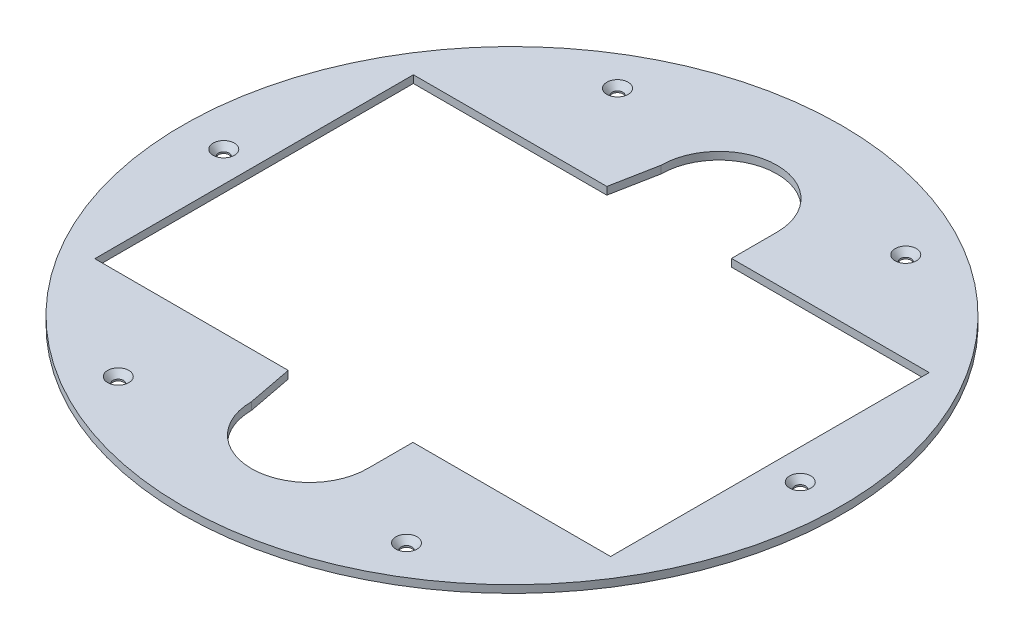
ISO-10303-21;
HEADER;
FILE_DESCRIPTION(('STEP AP214'),'2;1');
FILE_NAME('part.step','',(''),(''),'','','');
FILE_SCHEMA(('AUTOMOTIVE_DESIGN { 1 0 10303 214 1 1 1 1 }'));
ENDSEC;
DATA;
#1=APPLICATION_CONTEXT('core data for automotive mechanical design processes');
#2=APPLICATION_PROTOCOL_DEFINITION('international standard','automotive_design',2000,#1);
#3=PRODUCT_CONTEXT('',#1,'mechanical');
#4=PRODUCT('Part','Part','',(#3));
#5=PRODUCT_RELATED_PRODUCT_CATEGORY('part','',(#4));
#6=PRODUCT_DEFINITION_FORMATION('','',#4);
#7=PRODUCT_DEFINITION_CONTEXT('part definition',#1,'design');
#8=PRODUCT_DEFINITION('design','',#6,#7);
#9=PRODUCT_DEFINITION_SHAPE('','',#8);
#10=(LENGTH_UNIT() NAMED_UNIT(*) SI_UNIT(.MILLI.,.METRE.));
#11=(NAMED_UNIT(*) PLANE_ANGLE_UNIT() SI_UNIT($,.RADIAN.));
#12=(NAMED_UNIT(*) SI_UNIT($,.STERADIAN.) SOLID_ANGLE_UNIT());
#13=UNCERTAINTY_MEASURE_WITH_UNIT(LENGTH_MEASURE(1.E-05),#10,'distance_accuracy_value','');
#14=(GEOMETRIC_REPRESENTATION_CONTEXT(3) GLOBAL_UNCERTAINTY_ASSIGNED_CONTEXT((#13)) GLOBAL_UNIT_ASSIGNED_CONTEXT((#10,
#11,#12)) REPRESENTATION_CONTEXT('',''));
#15=CARTESIAN_POINT('',(0.,0.,0.));
#16=DIRECTION('',(0.,0.,1.));
#17=DIRECTION('',(1.,0.,0.));
#18=AXIS2_PLACEMENT_3D('',#15,#16,#17);
#19=CARTESIAN_POINT('',(0.,3.175,0.));
#20=DIRECTION('',(0.,-1.,0.));
#21=DIRECTION('',(0.,0.,-1.));
#22=AXIS2_PLACEMENT_3D('',#19,#20,#21);
#23=CYLINDRICAL_SURFACE('',#22,137.941576563057);
#24=CARTESIAN_POINT('',(0.,3.175,0.));
#25=DIRECTION('',(0.,1.,0.));
#26=DIRECTION('',(0.,0.,1.));
#27=AXIS2_PLACEMENT_3D('',#24,#25,#26);
#28=CIRCLE('',#27,137.941576563057);
#29=CARTESIAN_POINT('',(0.,3.175,137.941576563057));
#30=VERTEX_POINT('',#29);
#31=EDGE_CURVE('E11',#30,#30,#28,.T.);
#32=ORIENTED_EDGE('',*,*,#31,.F.);
#33=EDGE_LOOP('',(#32));
#34=FACE_BOUND('',#33,.T.);
#35=CARTESIAN_POINT('',(0.,0.,0.));
#36=DIRECTION('',(0.,1.,0.));
#37=DIRECTION('',(0.,0.,1.));
#38=AXIS2_PLACEMENT_3D('',#35,#36,#37);
#39=CIRCLE('',#38,137.941576563057);
#40=CARTESIAN_POINT('',(0.,0.,137.941576563057));
#41=VERTEX_POINT('',#40);
#42=EDGE_CURVE('E34',#41,#41,#39,.T.);
#43=ORIENTED_EDGE('',*,*,#42,.T.);
#44=EDGE_LOOP('',(#43));
#45=FACE_BOUND('',#44,.T.);
#46=ADVANCED_FACE('F31',(#34,#45),#23,.T.);
#47=CARTESIAN_POINT('',(0.,3.175,0.));
#48=DIRECTION('',(0.,1.,0.));
#49=DIRECTION('',(0.,0.,1.));
#50=AXIS2_PLACEMENT_3D('',#47,#48,#49);
#51=PLANE('',#50);
#52=CARTESIAN_POINT('',(-60.3250000000012,3.175,-104.485964966592));
#53=DIRECTION('',(0.,1.,0.));
#54=DIRECTION('',(0.,0.,1.));
#55=AXIS2_PLACEMENT_3D('',#52,#53,#54);
#56=CIRCLE('',#55,4.445);
#57=CARTESIAN_POINT('',(-60.3250000000012,3.175,-100.040964966592));
#58=VERTEX_POINT('',#57);
#59=EDGE_CURVE('E514',#58,#58,#56,.T.);
#60=ORIENTED_EDGE('',*,*,#59,.F.);
#61=EDGE_LOOP('',(#60));
#62=FACE_BOUND('',#61,.T.);
#63=CARTESIAN_POINT('',(60.324999999999,3.175,-104.485964966593));
#64=DIRECTION('',(0.,1.,0.));
#65=DIRECTION('',(0.,0.,1.));
#66=AXIS2_PLACEMENT_3D('',#63,#64,#65);
#67=CIRCLE('',#66,4.445);
#68=CARTESIAN_POINT('',(60.324999999999,3.175,-100.040964966593));
#69=VERTEX_POINT('',#68);
#70=EDGE_CURVE('E520',#69,#69,#67,.T.);
#71=ORIENTED_EDGE('',*,*,#70,.F.);
#72=EDGE_LOOP('',(#71));
#73=FACE_BOUND('',#72,.T.);
#74=CARTESIAN_POINT('',(120.65,3.175,-8.42494447062848E-13));
#75=DIRECTION('',(0.,1.,0.));
#76=DIRECTION('',(0.,0.,1.));
#77=AXIS2_PLACEMENT_3D('',#74,#75,#76);
#78=CIRCLE('',#77,4.44499999999999);
#79=CARTESIAN_POINT('',(120.65,3.175,4.44499999999915));
#80=VERTEX_POINT('',#79);
#81=EDGE_CURVE('E529',#80,#80,#78,.T.);
#82=ORIENTED_EDGE('',*,*,#81,.F.);
#83=EDGE_LOOP('',(#82));
#84=FACE_BOUND('',#83,.T.);
#85=CARTESIAN_POINT('',(60.3250000000005,3.175,104.485964966592));
#86=DIRECTION('',(0.,1.,0.));
#87=DIRECTION('',(0.,0.,1.));
#88=AXIS2_PLACEMENT_3D('',#85,#86,#87);
#89=CIRCLE('',#88,4.445);
#90=CARTESIAN_POINT('',(60.3250000000005,3.175,108.930964966592));
#91=VERTEX_POINT('',#90);
#92=EDGE_CURVE('E538',#91,#91,#89,.T.);
#93=ORIENTED_EDGE('',*,*,#92,.F.);
#94=EDGE_LOOP('',(#93));
#95=FACE_BOUND('',#94,.T.);
#96=CARTESIAN_POINT('',(-60.3249999999998,3.175,104.485964966593));
#97=DIRECTION('',(0.,1.,0.));
#98=DIRECTION('',(0.,0.,1.));
#99=AXIS2_PLACEMENT_3D('',#96,#97,#98);
#100=CIRCLE('',#99,4.445);
#101=CARTESIAN_POINT('',(-60.3249999999998,3.175,108.930964966593));
#102=VERTEX_POINT('',#101);
#103=EDGE_CURVE('E547',#102,#102,#100,.T.);
#104=ORIENTED_EDGE('',*,*,#103,.F.);
#105=EDGE_LOOP('',(#104));
#106=FACE_BOUND('',#105,.T.);
#107=CARTESIAN_POINT('',(-120.65,3.175,0.));
#108=DIRECTION('',(0.,1.,0.));
#109=DIRECTION('',(0.,0.,1.));
#110=AXIS2_PLACEMENT_3D('',#107,#108,#109);
#111=CIRCLE('',#110,4.445);
#112=CARTESIAN_POINT('',(-120.65,3.175,4.445));
#113=VERTEX_POINT('',#112);
#114=EDGE_CURVE('E556',#113,#113,#111,.T.);
#115=ORIENTED_EDGE('',*,*,#114,.F.);
#116=EDGE_LOOP('',(#115));
#117=FACE_BOUND('',#116,.T.);
#118=DIRECTION('',(-1.,0.,0.));
#119=VECTOR('',#118,1.);
#120=CARTESIAN_POINT('',(25.2048780308007,3.175,-66.675));
#121=LINE('',#120,#119);
#122=CARTESIAN_POINT('',(107.95,3.175,-66.675));
#123=VERTEX_POINT('',#122);
#124=CARTESIAN_POINT('',(25.2048780308007,3.175,-66.675));
#125=VERTEX_POINT('',#124);
#126=EDGE_CURVE('E45',#123,#125,#121,.T.);
#127=ORIENTED_EDGE('',*,*,#126,.F.);
#128=DIRECTION('',(0.,0.,-1.));
#129=VECTOR('',#128,1.);
#130=CARTESIAN_POINT('',(107.95,3.175,66.675));
#131=LINE('',#130,#129);
#132=CARTESIAN_POINT('',(107.95,3.175,66.675));
#133=VERTEX_POINT('',#132);
#134=EDGE_CURVE('E138',#133,#123,#131,.T.);
#135=ORIENTED_EDGE('',*,*,#134,.F.);
#136=DIRECTION('',(1.,0.,0.));
#137=VECTOR('',#136,1.);
#138=CARTESIAN_POINT('',(25.2048780308007,3.175,66.675));
#139=LINE('',#138,#137);
#140=CARTESIAN_POINT('',(25.2048780308007,3.175,66.675));
#141=VERTEX_POINT('',#140);
#142=EDGE_CURVE('E141',#141,#133,#139,.T.);
#143=ORIENTED_EDGE('',*,*,#142,.F.);
#144=DIRECTION('',(0.,0.,-1.));
#145=VECTOR('',#144,1.);
#146=CARTESIAN_POINT('',(25.2048780308007,3.175,85.725));
#147=LINE('',#146,#145);
#148=CARTESIAN_POINT('',(25.2048780308007,3.175,85.725));
#149=VERTEX_POINT('',#148);
#150=EDGE_CURVE('E196',#149,#141,#147,.T.);
#151=ORIENTED_EDGE('',*,*,#150,.F.);
#152=CARTESIAN_POINT('',(0.937561054404547,3.175,85.725));
#153=DIRECTION('',(0.,1.,0.));
#154=DIRECTION('',(0.,0.,1.));
#155=AXIS2_PLACEMENT_3D('',#152,#153,#154);
#156=CIRCLE('',#155,24.2673169763962);
#157=CARTESIAN_POINT('',(-23.3297559219917,3.175,85.725));
#158=VERTEX_POINT('',#157);
#159=EDGE_CURVE('E193',#158,#149,#156,.T.);
#160=ORIENTED_EDGE('',*,*,#159,.F.);
#161=DIRECTION('',(0.188563152175409,0.,0.982061066146944));
#162=VECTOR('',#161,1.);
#163=CARTESIAN_POINT('',(-23.3297559219917,3.175,85.725));
#164=LINE('',#163,#162);
#165=CARTESIAN_POINT('',(-26.9875,3.175,66.675));
#166=VERTEX_POINT('',#165);
#167=EDGE_CURVE('E190',#166,#158,#164,.T.);
#168=ORIENTED_EDGE('',*,*,#167,.F.);
#169=DIRECTION('',(1.,0.,0.));
#170=VECTOR('',#169,1.);
#171=CARTESIAN_POINT('',(-107.95,3.175,66.675));
#172=LINE('',#171,#170);
#173=CARTESIAN_POINT('',(-107.95,3.175,66.675));
#174=VERTEX_POINT('',#173);
#175=EDGE_CURVE('E187',#174,#166,#172,.T.);
#176=ORIENTED_EDGE('',*,*,#175,.F.);
#177=DIRECTION('',(0.,0.,1.));
#178=VECTOR('',#177,1.);
#179=CARTESIAN_POINT('',(-107.95,3.175,66.675));
#180=LINE('',#179,#178);
#181=CARTESIAN_POINT('',(-107.95,3.175,-66.675));
#182=VERTEX_POINT('',#181);
#183=EDGE_CURVE('E184',#182,#174,#180,.T.);
#184=ORIENTED_EDGE('',*,*,#183,.F.);
#185=DIRECTION('',(-1.,0.,0.));
#186=VECTOR('',#185,1.);
#187=CARTESIAN_POINT('',(-107.95,3.175,-66.675));
#188=LINE('',#187,#186);
#189=CARTESIAN_POINT('',(-26.9875,3.175,-66.675));
#190=VERTEX_POINT('',#189);
#191=EDGE_CURVE('E181',#190,#182,#188,.T.);
#192=ORIENTED_EDGE('',*,*,#191,.F.);
#193=DIRECTION('',(-0.188563152175409,0.,0.982061066146944));
#194=VECTOR('',#193,1.);
#195=CARTESIAN_POINT('',(-23.3297559219917,3.175,-85.725));
#196=LINE('',#195,#194);
#197=CARTESIAN_POINT('',(-23.3297559219917,3.175,-85.725));
#198=VERTEX_POINT('',#197);
#199=EDGE_CURVE('E178',#198,#190,#196,.T.);
#200=ORIENTED_EDGE('',*,*,#199,.F.);
#201=CARTESIAN_POINT('',(0.937561054404547,3.175,-85.725));
#202=DIRECTION('',(0.,1.,0.));
#203=DIRECTION('',(0.,0.,-1.));
#204=AXIS2_PLACEMENT_3D('',#201,#202,#203);
#205=CIRCLE('',#204,24.2673169763962);
#206=CARTESIAN_POINT('',(25.2048780308007,3.175,-85.725));
#207=VERTEX_POINT('',#206);
#208=EDGE_CURVE('E175',#207,#198,#205,.T.);
#209=ORIENTED_EDGE('',*,*,#208,.F.);
#210=DIRECTION('',(0.,0.,-1.));
#211=VECTOR('',#210,1.);
#212=CARTESIAN_POINT('',(25.2048780308007,3.175,-85.725));
#213=LINE('',#212,#211);
#214=EDGE_CURVE('E173',#125,#207,#213,.T.);
#215=ORIENTED_EDGE('',*,*,#214,.F.);
#216=EDGE_LOOP('',(#127,#135,#143,#151,#160,#168,#176,#184,#192,#200,#209,#215));
#217=FACE_BOUND('',#216,.T.);
#218=ORIENTED_EDGE('',*,*,#31,.T.);
#219=EDGE_LOOP('',(#218));
#220=FACE_BOUND('',#219,.T.);
#221=ADVANCED_FACE('F225',(#62,#73,#84,#95,#106,#117,#217,#220),#51,.T.);
#222=CARTESIAN_POINT('',(0.,0.,0.));
#223=DIRECTION('',(0.,1.,0.));
#224=DIRECTION('',(0.,0.,1.));
#225=AXIS2_PLACEMENT_3D('',#222,#223,#224);
#226=PLANE('',#225);
#227=CARTESIAN_POINT('',(-60.3250000000012,0.,-104.485964966592));
#228=DIRECTION('',(0.,1.,0.));
#229=DIRECTION('',(0.,0.,1.));
#230=AXIS2_PLACEMENT_3D('',#227,#228,#229);
#231=CIRCLE('',#230,2.2479);
#232=CARTESIAN_POINT('',(-60.3250000000012,0.,-102.238064966592));
#233=VERTEX_POINT('',#232);
#234=EDGE_CURVE('E516',#233,#233,#231,.T.);
#235=ORIENTED_EDGE('',*,*,#234,.T.);
#236=EDGE_LOOP('',(#235));
#237=FACE_BOUND('',#236,.T.);
#238=CARTESIAN_POINT('',(60.324999999999,0.,-104.485964966593));
#239=DIRECTION('',(0.,1.,0.));
#240=DIRECTION('',(0.,0.,1.));
#241=AXIS2_PLACEMENT_3D('',#238,#239,#240);
#242=CIRCLE('',#241,2.2479);
#243=CARTESIAN_POINT('',(60.324999999999,0.,-102.238064966593));
#244=VERTEX_POINT('',#243);
#245=EDGE_CURVE('E526',#244,#244,#242,.T.);
#246=ORIENTED_EDGE('',*,*,#245,.T.);
#247=EDGE_LOOP('',(#246));
#248=FACE_BOUND('',#247,.T.);
#249=CARTESIAN_POINT('',(120.65,0.,-8.42494447062848E-13));
#250=DIRECTION('',(0.,1.,0.));
#251=DIRECTION('',(0.,0.,1.));
#252=AXIS2_PLACEMENT_3D('',#249,#250,#251);
#253=CIRCLE('',#252,2.2479);
#254=CARTESIAN_POINT('',(120.65,0.,2.24789999999915));
#255=VERTEX_POINT('',#254);
#256=EDGE_CURVE('E535',#255,#255,#253,.T.);
#257=ORIENTED_EDGE('',*,*,#256,.T.);
#258=EDGE_LOOP('',(#257));
#259=FACE_BOUND('',#258,.T.);
#260=CARTESIAN_POINT('',(60.3250000000005,0.,104.485964966592));
#261=DIRECTION('',(0.,1.,0.));
#262=DIRECTION('',(0.,0.,1.));
#263=AXIS2_PLACEMENT_3D('',#260,#261,#262);
#264=CIRCLE('',#263,2.2479);
#265=CARTESIAN_POINT('',(60.3250000000005,0.,106.733864966592));
#266=VERTEX_POINT('',#265);
#267=EDGE_CURVE('E544',#266,#266,#264,.T.);
#268=ORIENTED_EDGE('',*,*,#267,.T.);
#269=EDGE_LOOP('',(#268));
#270=FACE_BOUND('',#269,.T.);
#271=CARTESIAN_POINT('',(-60.3249999999998,0.,104.485964966593));
#272=DIRECTION('',(0.,1.,0.));
#273=DIRECTION('',(0.,0.,1.));
#274=AXIS2_PLACEMENT_3D('',#271,#272,#273);
#275=CIRCLE('',#274,2.2479);
#276=CARTESIAN_POINT('',(-60.3249999999998,0.,106.733864966593));
#277=VERTEX_POINT('',#276);
#278=EDGE_CURVE('E553',#277,#277,#275,.T.);
#279=ORIENTED_EDGE('',*,*,#278,.T.);
#280=EDGE_LOOP('',(#279));
#281=FACE_BOUND('',#280,.T.);
#282=CARTESIAN_POINT('',(-120.65,0.,0.));
#283=DIRECTION('',(0.,1.,0.));
#284=DIRECTION('',(0.,0.,1.));
#285=AXIS2_PLACEMENT_3D('',#282,#283,#284);
#286=CIRCLE('',#285,2.2479);
#287=CARTESIAN_POINT('',(-120.65,0.,2.2479));
#288=VERTEX_POINT('',#287);
#289=EDGE_CURVE('E144',#288,#288,#286,.T.);
#290=ORIENTED_EDGE('',*,*,#289,.T.);
#291=EDGE_LOOP('',(#290));
#292=FACE_BOUND('',#291,.T.);
#293=DIRECTION('',(0.,0.,-1.));
#294=VECTOR('',#293,1.);
#295=CARTESIAN_POINT('',(107.95,0.,66.675));
#296=LINE('',#295,#294);
#297=CARTESIAN_POINT('',(107.95,0.,66.675));
#298=VERTEX_POINT('',#297);
#299=CARTESIAN_POINT('',(107.95,0.,-66.675));
#300=VERTEX_POINT('',#299);
#301=EDGE_CURVE('E127',#298,#300,#296,.T.);
#302=ORIENTED_EDGE('',*,*,#301,.T.);
#303=DIRECTION('',(-1.,0.,0.));
#304=VECTOR('',#303,1.);
#305=CARTESIAN_POINT('',(25.2048780308007,0.,-66.675));
#306=LINE('',#305,#304);
#307=CARTESIAN_POINT('',(25.2048780308007,0.,-66.675));
#308=VERTEX_POINT('',#307);
#309=EDGE_CURVE('E121',#300,#308,#306,.T.);
#310=ORIENTED_EDGE('',*,*,#309,.T.);
#311=DIRECTION('',(0.,0.,-1.));
#312=VECTOR('',#311,1.);
#313=CARTESIAN_POINT('',(25.2048780308007,0.,-85.725));
#314=LINE('',#313,#312);
#315=CARTESIAN_POINT('',(25.2048780308007,0.,-85.725));
#316=VERTEX_POINT('',#315);
#317=EDGE_CURVE('E130',#308,#316,#314,.T.);
#318=ORIENTED_EDGE('',*,*,#317,.T.);
#319=CARTESIAN_POINT('',(0.937561054404547,0.,-85.725));
#320=DIRECTION('',(0.,1.,0.));
#321=DIRECTION('',(0.,0.,-1.));
#322=AXIS2_PLACEMENT_3D('',#319,#320,#321);
#323=CIRCLE('',#322,24.2673169763962);
#324=CARTESIAN_POINT('',(-23.3297559219917,0.,-85.725));
#325=VERTEX_POINT('',#324);
#326=EDGE_CURVE('E53',#316,#325,#323,.T.);
#327=ORIENTED_EDGE('',*,*,#326,.T.);
#328=DIRECTION('',(-0.188563152175409,0.,0.982061066146944));
#329=VECTOR('',#328,1.);
#330=CARTESIAN_POINT('',(-23.3297559219917,0.,-85.725));
#331=LINE('',#330,#329);
#332=CARTESIAN_POINT('',(-26.9875,0.,-66.675));
#333=VERTEX_POINT('',#332);
#334=EDGE_CURVE('E148',#325,#333,#331,.T.);
#335=ORIENTED_EDGE('',*,*,#334,.T.);
#336=DIRECTION('',(-1.,0.,0.));
#337=VECTOR('',#336,1.);
#338=CARTESIAN_POINT('',(-107.95,0.,-66.675));
#339=LINE('',#338,#337);
#340=CARTESIAN_POINT('',(-107.95,0.,-66.675));
#341=VERTEX_POINT('',#340);
#342=EDGE_CURVE('E151',#333,#341,#339,.T.);
#343=ORIENTED_EDGE('',*,*,#342,.T.);
#344=DIRECTION('',(0.,0.,1.));
#345=VECTOR('',#344,1.);
#346=CARTESIAN_POINT('',(-107.95,0.,66.675));
#347=LINE('',#346,#345);
#348=CARTESIAN_POINT('',(-107.95,0.,66.675));
#349=VERTEX_POINT('',#348);
#350=EDGE_CURVE('E154',#341,#349,#347,.T.);
#351=ORIENTED_EDGE('',*,*,#350,.T.);
#352=DIRECTION('',(1.,0.,0.));
#353=VECTOR('',#352,1.);
#354=CARTESIAN_POINT('',(-107.95,0.,66.675));
#355=LINE('',#354,#353);
#356=CARTESIAN_POINT('',(-26.9875,0.,66.675));
#357=VERTEX_POINT('',#356);
#358=EDGE_CURVE('E157',#349,#357,#355,.T.);
#359=ORIENTED_EDGE('',*,*,#358,.T.);
#360=DIRECTION('',(0.188563152175409,0.,0.982061066146944));
#361=VECTOR('',#360,1.);
#362=CARTESIAN_POINT('',(-23.3297559219917,0.,85.725));
#363=LINE('',#362,#361);
#364=CARTESIAN_POINT('',(-23.3297559219917,0.,85.725));
#365=VERTEX_POINT('',#364);
#366=EDGE_CURVE('E160',#357,#365,#363,.T.);
#367=ORIENTED_EDGE('',*,*,#366,.T.);
#368=CARTESIAN_POINT('',(0.937561054404547,0.,85.725));
#369=DIRECTION('',(0.,1.,0.));
#370=DIRECTION('',(0.,0.,1.));
#371=AXIS2_PLACEMENT_3D('',#368,#369,#370);
#372=CIRCLE('',#371,24.2673169763962);
#373=CARTESIAN_POINT('',(25.2048780308007,0.,85.725));
#374=VERTEX_POINT('',#373);
#375=EDGE_CURVE('E163',#365,#374,#372,.T.);
#376=ORIENTED_EDGE('',*,*,#375,.T.);
#377=DIRECTION('',(0.,0.,-1.));
#378=VECTOR('',#377,1.);
#379=CARTESIAN_POINT('',(25.2048780308007,0.,85.725));
#380=LINE('',#379,#378);
#381=CARTESIAN_POINT('',(25.2048780308007,0.,66.675));
#382=VERTEX_POINT('',#381);
#383=EDGE_CURVE('E166',#374,#382,#380,.T.);
#384=ORIENTED_EDGE('',*,*,#383,.T.);
#385=DIRECTION('',(1.,0.,0.));
#386=VECTOR('',#385,1.);
#387=CARTESIAN_POINT('',(25.2048780308007,0.,66.675));
#388=LINE('',#387,#386);
#389=EDGE_CURVE('E169',#382,#298,#388,.T.);
#390=ORIENTED_EDGE('',*,*,#389,.T.);
#391=EDGE_LOOP('',(#302,#310,#318,#327,#335,#343,#351,#359,#367,#376,#384,#390));
#392=FACE_BOUND('',#391,.T.);
#393=ORIENTED_EDGE('',*,*,#42,.F.);
#394=EDGE_LOOP('',(#393));
#395=FACE_BOUND('',#394,.T.);
#396=ADVANCED_FACE('F134',(#237,#248,#259,#270,#281,#292,#392,#395),#226,.F.);
#397=CARTESIAN_POINT('',(25.2048780308007,0.,-66.675));
#398=DIRECTION('',(0.,0.,-1.));
#399=DIRECTION('',(-1.,0.,0.));
#400=AXIS2_PLACEMENT_3D('',#397,#398,#399);
#401=PLANE('',#400);
#402=ORIENTED_EDGE('',*,*,#126,.T.);
#403=DIRECTION('',(0.,1.,0.));
#404=VECTOR('',#403,1.);
#405=CARTESIAN_POINT('',(25.2048780308007,0.,-66.675));
#406=LINE('',#405,#404);
#407=EDGE_CURVE('E117',#308,#125,#406,.T.);
#408=ORIENTED_EDGE('',*,*,#407,.F.);
#409=ORIENTED_EDGE('',*,*,#309,.F.);
#410=DIRECTION('',(0.,1.,0.));
#411=VECTOR('',#410,1.);
#412=CARTESIAN_POINT('',(107.95,0.,-66.675));
#413=LINE('',#412,#411);
#414=EDGE_CURVE('E201',#300,#123,#413,.T.);
#415=ORIENTED_EDGE('',*,*,#414,.T.);
#416=EDGE_LOOP('',(#402,#408,#409,#415));
#417=FACE_BOUND('',#416,.T.);
#418=ADVANCED_FACE('F119',(#417),#401,.F.);
#419=CARTESIAN_POINT('',(107.95,0.,66.675));
#420=DIRECTION('',(1.,0.,0.));
#421=DIRECTION('',(0.,0.,-1.));
#422=AXIS2_PLACEMENT_3D('',#419,#420,#421);
#423=PLANE('',#422);
#424=ORIENTED_EDGE('',*,*,#134,.T.);
#425=ORIENTED_EDGE('',*,*,#414,.F.);
#426=ORIENTED_EDGE('',*,*,#301,.F.);
#427=DIRECTION('',(0.,1.,0.));
#428=VECTOR('',#427,1.);
#429=CARTESIAN_POINT('',(107.95,0.,66.675));
#430=LINE('',#429,#428);
#431=EDGE_CURVE('E203',#298,#133,#430,.T.);
#432=ORIENTED_EDGE('',*,*,#431,.T.);
#433=EDGE_LOOP('',(#424,#425,#426,#432));
#434=FACE_BOUND('',#433,.T.);
#435=ADVANCED_FACE('F260',(#434),#423,.F.);
#436=CARTESIAN_POINT('',(25.2048780308007,0.,66.675));
#437=DIRECTION('',(0.,0.,1.));
#438=DIRECTION('',(1.,0.,0.));
#439=AXIS2_PLACEMENT_3D('',#436,#437,#438);
#440=PLANE('',#439);
#441=ORIENTED_EDGE('',*,*,#142,.T.);
#442=ORIENTED_EDGE('',*,*,#431,.F.);
#443=ORIENTED_EDGE('',*,*,#389,.F.);
#444=DIRECTION('',(0.,1.,0.));
#445=VECTOR('',#444,1.);
#446=CARTESIAN_POINT('',(25.2048780308007,0.,66.675));
#447=LINE('',#446,#445);
#448=EDGE_CURVE('E205',#382,#141,#447,.T.);
#449=ORIENTED_EDGE('',*,*,#448,.T.);
#450=EDGE_LOOP('',(#441,#442,#443,#449));
#451=FACE_BOUND('',#450,.T.);
#452=ADVANCED_FACE('F256',(#451),#440,.F.);
#453=CARTESIAN_POINT('',(25.2048780308007,0.,85.725));
#454=DIRECTION('',(1.,0.,0.));
#455=DIRECTION('',(0.,0.,-1.));
#456=AXIS2_PLACEMENT_3D('',#453,#454,#455);
#457=PLANE('',#456);
#458=ORIENTED_EDGE('',*,*,#150,.T.);
#459=ORIENTED_EDGE('',*,*,#448,.F.);
#460=ORIENTED_EDGE('',*,*,#383,.F.);
#461=DIRECTION('',(0.,1.,0.));
#462=VECTOR('',#461,1.);
#463=CARTESIAN_POINT('',(25.2048780308007,0.,85.725));
#464=LINE('',#463,#462);
#465=EDGE_CURVE('E207',#374,#149,#464,.T.);
#466=ORIENTED_EDGE('',*,*,#465,.T.);
#467=EDGE_LOOP('',(#458,#459,#460,#466));
#468=FACE_BOUND('',#467,.T.);
#469=ADVANCED_FACE('F253',(#468),#457,.F.);
#470=CARTESIAN_POINT('',(0.937561054404547,0.,85.725));
#471=DIRECTION('',(0.,1.,0.));
#472=DIRECTION('',(0.,0.,1.));
#473=AXIS2_PLACEMENT_3D('',#470,#471,#472);
#474=CYLINDRICAL_SURFACE('',#473,24.2673169763962);
#475=ORIENTED_EDGE('',*,*,#159,.T.);
#476=ORIENTED_EDGE('',*,*,#465,.F.);
#477=ORIENTED_EDGE('',*,*,#375,.F.);
#478=DIRECTION('',(0.,1.,0.));
#479=VECTOR('',#478,1.);
#480=CARTESIAN_POINT('',(-23.3297559219917,0.,85.725));
#481=LINE('',#480,#479);
#482=EDGE_CURVE('E209',#365,#158,#481,.T.);
#483=ORIENTED_EDGE('',*,*,#482,.T.);
#484=EDGE_LOOP('',(#475,#476,#477,#483));
#485=FACE_BOUND('',#484,.T.);
#486=ADVANCED_FACE('F249',(#485),#474,.F.);
#487=CARTESIAN_POINT('',(-23.3297559219917,0.,85.725));
#488=DIRECTION('',(-0.982061066146945,0.,0.188563152175409));
#489=DIRECTION('',(0.188563152175409,0.,0.982061066146945));
#490=AXIS2_PLACEMENT_3D('',#487,#488,#489);
#491=PLANE('',#490);
#492=ORIENTED_EDGE('',*,*,#167,.T.);
#493=ORIENTED_EDGE('',*,*,#482,.F.);
#494=ORIENTED_EDGE('',*,*,#366,.F.);
#495=DIRECTION('',(0.,1.,0.));
#496=VECTOR('',#495,1.);
#497=CARTESIAN_POINT('',(-26.9875,0.,66.675));
#498=LINE('',#497,#496);
#499=EDGE_CURVE('E211',#357,#166,#498,.T.);
#500=ORIENTED_EDGE('',*,*,#499,.T.);
#501=EDGE_LOOP('',(#492,#493,#494,#500));
#502=FACE_BOUND('',#501,.T.);
#503=ADVANCED_FACE('F245',(#502),#491,.F.);
#504=CARTESIAN_POINT('',(-107.95,0.,66.675));
#505=DIRECTION('',(0.,0.,1.));
#506=DIRECTION('',(1.,0.,0.));
#507=AXIS2_PLACEMENT_3D('',#504,#505,#506);
#508=PLANE('',#507);
#509=ORIENTED_EDGE('',*,*,#175,.T.);
#510=ORIENTED_EDGE('',*,*,#499,.F.);
#511=ORIENTED_EDGE('',*,*,#358,.F.);
#512=DIRECTION('',(0.,1.,0.));
#513=VECTOR('',#512,1.);
#514=CARTESIAN_POINT('',(-107.95,0.,66.675));
#515=LINE('',#514,#513);
#516=EDGE_CURVE('E213',#349,#174,#515,.T.);
#517=ORIENTED_EDGE('',*,*,#516,.T.);
#518=EDGE_LOOP('',(#509,#510,#511,#517));
#519=FACE_BOUND('',#518,.T.);
#520=ADVANCED_FACE('F241',(#519),#508,.F.);
#521=CARTESIAN_POINT('',(-107.95,0.,66.675));
#522=DIRECTION('',(-1.,0.,0.));
#523=DIRECTION('',(0.,0.,1.));
#524=AXIS2_PLACEMENT_3D('',#521,#522,#523);
#525=PLANE('',#524);
#526=ORIENTED_EDGE('',*,*,#183,.T.);
#527=ORIENTED_EDGE('',*,*,#516,.F.);
#528=ORIENTED_EDGE('',*,*,#350,.F.);
#529=DIRECTION('',(0.,1.,0.));
#530=VECTOR('',#529,1.);
#531=CARTESIAN_POINT('',(-107.95,0.,-66.675));
#532=LINE('',#531,#530);
#533=EDGE_CURVE('E215',#341,#182,#532,.T.);
#534=ORIENTED_EDGE('',*,*,#533,.T.);
#535=EDGE_LOOP('',(#526,#527,#528,#534));
#536=FACE_BOUND('',#535,.T.);
#537=ADVANCED_FACE('F237',(#536),#525,.F.);
#538=CARTESIAN_POINT('',(-107.95,0.,-66.675));
#539=DIRECTION('',(0.,0.,-1.));
#540=DIRECTION('',(-1.,0.,0.));
#541=AXIS2_PLACEMENT_3D('',#538,#539,#540);
#542=PLANE('',#541);
#543=ORIENTED_EDGE('',*,*,#191,.T.);
#544=ORIENTED_EDGE('',*,*,#533,.F.);
#545=ORIENTED_EDGE('',*,*,#342,.F.);
#546=DIRECTION('',(0.,1.,0.));
#547=VECTOR('',#546,1.);
#548=CARTESIAN_POINT('',(-26.9875,0.,-66.675));
#549=LINE('',#548,#547);
#550=EDGE_CURVE('E217',#333,#190,#549,.T.);
#551=ORIENTED_EDGE('',*,*,#550,.T.);
#552=EDGE_LOOP('',(#543,#544,#545,#551));
#553=FACE_BOUND('',#552,.T.);
#554=ADVANCED_FACE('F235',(#553),#542,.F.);
#555=CARTESIAN_POINT('',(-23.3297559219917,0.,-85.725));
#556=DIRECTION('',(-0.982061066146945,0.,-0.188563152175409));
#557=DIRECTION('',(-0.188563152175409,0.,0.982061066146945));
#558=AXIS2_PLACEMENT_3D('',#555,#556,#557);
#559=PLANE('',#558);
#560=ORIENTED_EDGE('',*,*,#199,.T.);
#561=ORIENTED_EDGE('',*,*,#550,.F.);
#562=ORIENTED_EDGE('',*,*,#334,.F.);
#563=DIRECTION('',(0.,1.,0.));
#564=VECTOR('',#563,1.);
#565=CARTESIAN_POINT('',(-23.3297559219917,0.,-85.725));
#566=LINE('',#565,#564);
#567=EDGE_CURVE('E219',#325,#198,#566,.T.);
#568=ORIENTED_EDGE('',*,*,#567,.T.);
#569=EDGE_LOOP('',(#560,#561,#562,#568));
#570=FACE_BOUND('',#569,.T.);
#571=ADVANCED_FACE('F230',(#570),#559,.F.);
#572=CARTESIAN_POINT('',(0.937561054404547,0.,-85.725));
#573=DIRECTION('',(0.,1.,0.));
#574=DIRECTION('',(0.,0.,1.));
#575=AXIS2_PLACEMENT_3D('',#572,#573,#574);
#576=CYLINDRICAL_SURFACE('',#575,24.2673169763962);
#577=ORIENTED_EDGE('',*,*,#208,.T.);
#578=ORIENTED_EDGE('',*,*,#567,.F.);
#579=ORIENTED_EDGE('',*,*,#326,.F.);
#580=DIRECTION('',(0.,1.,0.));
#581=VECTOR('',#580,1.);
#582=CARTESIAN_POINT('',(25.2048780308007,0.,-85.725));
#583=LINE('',#582,#581);
#584=EDGE_CURVE('E126',#316,#207,#583,.T.);
#585=ORIENTED_EDGE('',*,*,#584,.T.);
#586=EDGE_LOOP('',(#577,#578,#579,#585));
#587=FACE_BOUND('',#586,.T.);
#588=ADVANCED_FACE('F221',(#587),#576,.F.);
#589=CARTESIAN_POINT('',(25.2048780308007,0.,-85.725));
#590=DIRECTION('',(1.,0.,0.));
#591=DIRECTION('',(0.,0.,-1.));
#592=AXIS2_PLACEMENT_3D('',#589,#590,#591);
#593=PLANE('',#592);
#594=ORIENTED_EDGE('',*,*,#214,.T.);
#595=ORIENTED_EDGE('',*,*,#584,.F.);
#596=ORIENTED_EDGE('',*,*,#317,.F.);
#597=ORIENTED_EDGE('',*,*,#407,.T.);
#598=EDGE_LOOP('',(#594,#595,#596,#597));
#599=FACE_BOUND('',#598,.T.);
#600=ADVANCED_FACE('F131',(#599),#593,.F.);
#601=CARTESIAN_POINT('',(-120.65,3.175,0.));
#602=DIRECTION('',(0.,1.,0.));
#603=DIRECTION('',(0.,0.,1.));
#604=AXIS2_PLACEMENT_3D('',#601,#602,#603);
#605=CYLINDRICAL_SURFACE('',#604,2.2479);
#606=ORIENTED_EDGE('',*,*,#289,.F.);
#607=EDGE_LOOP('',(#606));
#608=FACE_BOUND('',#607,.T.);
#609=CARTESIAN_POINT('',(-120.65,0.647525572494723,0.));
#610=DIRECTION('',(0.,1.,0.));
#611=DIRECTION('',(0.,0.,1.));
#612=AXIS2_PLACEMENT_3D('',#609,#610,#611);
#613=CIRCLE('',#612,2.2479);
#614=CARTESIAN_POINT('',(-120.65,0.647525572494723,2.2479));
#615=VERTEX_POINT('',#614);
#616=EDGE_CURVE('E558',#615,#615,#613,.T.);
#617=ORIENTED_EDGE('',*,*,#616,.T.);
#618=EDGE_LOOP('',(#617));
#619=FACE_BOUND('',#618,.T.);
#620=ADVANCED_FACE('F290',(#608,#619),#605,.F.);
#621=CARTESIAN_POINT('',(-120.65,3.175,0.));
#622=DIRECTION('',(0.,1.,0.));
#623=DIRECTION('',(0.,0.,1.));
#624=AXIS2_PLACEMENT_3D('',#621,#622,#623);
#625=CONICAL_SURFACE('',#624,4.445,0.715584993317677);
#626=ORIENTED_EDGE('',*,*,#616,.F.);
#627=EDGE_LOOP('',(#626));
#628=FACE_BOUND('',#627,.T.);
#629=ORIENTED_EDGE('',*,*,#114,.T.);
#630=EDGE_LOOP('',(#629));
#631=FACE_BOUND('',#630,.T.);
#632=ADVANCED_FACE('F348',(#628,#631),#625,.F.);
#633=CARTESIAN_POINT('',(-60.3249999999998,3.175,104.485964966593));
#634=DIRECTION('',(0.,1.,0.));
#635=DIRECTION('',(0.,0.,1.));
#636=AXIS2_PLACEMENT_3D('',#633,#634,#635);
#637=CYLINDRICAL_SURFACE('',#636,2.2479);
#638=ORIENTED_EDGE('',*,*,#278,.F.);
#639=EDGE_LOOP('',(#638));
#640=FACE_BOUND('',#639,.T.);
#641=CARTESIAN_POINT('',(-60.3249999999998,0.647525572494723,104.485964966593));
#642=DIRECTION('',(0.,1.,0.));
#643=DIRECTION('',(0.,0.,1.));
#644=AXIS2_PLACEMENT_3D('',#641,#642,#643);
#645=CIRCLE('',#644,2.2479);
#646=CARTESIAN_POINT('',(-60.3249999999998,0.647525572494723,106.733864966593));
#647=VERTEX_POINT('',#646);
#648=EDGE_CURVE('E550',#647,#647,#645,.T.);
#649=ORIENTED_EDGE('',*,*,#648,.T.);
#650=EDGE_LOOP('',(#649));
#651=FACE_BOUND('',#650,.T.);
#652=ADVANCED_FACE('F355',(#640,#651),#637,.F.);
#653=CARTESIAN_POINT('',(-60.3249999999998,3.175,104.485964966593));
#654=DIRECTION('',(0.,1.,0.));
#655=DIRECTION('',(0.,0.,1.));
#656=AXIS2_PLACEMENT_3D('',#653,#654,#655);
#657=CONICAL_SURFACE('',#656,4.445,0.715584993317676);
#658=ORIENTED_EDGE('',*,*,#648,.F.);
#659=EDGE_LOOP('',(#658));
#660=FACE_BOUND('',#659,.T.);
#661=ORIENTED_EDGE('',*,*,#103,.T.);
#662=EDGE_LOOP('',(#661));
#663=FACE_BOUND('',#662,.T.);
#664=ADVANCED_FACE('F364',(#660,#663),#657,.F.);
#665=CARTESIAN_POINT('',(60.3250000000005,3.175,104.485964966592));
#666=DIRECTION('',(0.,1.,0.));
#667=DIRECTION('',(0.,0.,1.));
#668=AXIS2_PLACEMENT_3D('',#665,#666,#667);
#669=CYLINDRICAL_SURFACE('',#668,2.2479);
#670=ORIENTED_EDGE('',*,*,#267,.F.);
#671=EDGE_LOOP('',(#670));
#672=FACE_BOUND('',#671,.T.);
#673=CARTESIAN_POINT('',(60.3250000000005,0.647525572494723,104.485964966592));
#674=DIRECTION('',(0.,1.,0.));
#675=DIRECTION('',(0.,0.,1.));
#676=AXIS2_PLACEMENT_3D('',#673,#674,#675);
#677=CIRCLE('',#676,2.2479);
#678=CARTESIAN_POINT('',(60.3250000000005,0.647525572494723,106.733864966592));
#679=VERTEX_POINT('',#678);
#680=EDGE_CURVE('E541',#679,#679,#677,.T.);
#681=ORIENTED_EDGE('',*,*,#680,.T.);
#682=EDGE_LOOP('',(#681));
#683=FACE_BOUND('',#682,.T.);
#684=ADVANCED_FACE('F372',(#672,#683),#669,.F.);
#685=CARTESIAN_POINT('',(60.3250000000005,3.175,104.485964966592));
#686=DIRECTION('',(0.,1.,0.));
#687=DIRECTION('',(0.,0.,1.));
#688=AXIS2_PLACEMENT_3D('',#685,#686,#687);
#689=CONICAL_SURFACE('',#688,4.445,0.715584993317677);
#690=ORIENTED_EDGE('',*,*,#680,.F.);
#691=EDGE_LOOP('',(#690));
#692=FACE_BOUND('',#691,.T.);
#693=ORIENTED_EDGE('',*,*,#92,.T.);
#694=EDGE_LOOP('',(#693));
#695=FACE_BOUND('',#694,.T.);
#696=ADVANCED_FACE('F380',(#692,#695),#689,.F.);
#697=CARTESIAN_POINT('',(120.65,3.175,-8.42494447062848E-13));
#698=DIRECTION('',(0.,1.,0.));
#699=DIRECTION('',(0.,0.,1.));
#700=AXIS2_PLACEMENT_3D('',#697,#698,#699);
#701=CYLINDRICAL_SURFACE('',#700,2.2479);
#702=ORIENTED_EDGE('',*,*,#256,.F.);
#703=EDGE_LOOP('',(#702));
#704=FACE_BOUND('',#703,.T.);
#705=CARTESIAN_POINT('',(120.65,0.647525572494723,-8.42494447062848E-13));
#706=DIRECTION('',(0.,1.,0.));
#707=DIRECTION('',(0.,0.,1.));
#708=AXIS2_PLACEMENT_3D('',#705,#706,#707);
#709=CIRCLE('',#708,2.2479);
#710=CARTESIAN_POINT('',(120.65,0.647525572494723,2.24789999999915));
#711=VERTEX_POINT('',#710);
#712=EDGE_CURVE('E532',#711,#711,#709,.T.);
#713=ORIENTED_EDGE('',*,*,#712,.T.);
#714=EDGE_LOOP('',(#713));
#715=FACE_BOUND('',#714,.T.);
#716=ADVANCED_FACE('F388',(#704,#715),#701,.F.);
#717=CARTESIAN_POINT('',(120.65,3.175,-8.42494447062848E-13));
#718=DIRECTION('',(0.,1.,0.));
#719=DIRECTION('',(0.,0.,1.));
#720=AXIS2_PLACEMENT_3D('',#717,#718,#719);
#721=CONICAL_SURFACE('',#720,4.44499999999999,0.715584993317674);
#722=ORIENTED_EDGE('',*,*,#712,.F.);
#723=EDGE_LOOP('',(#722));
#724=FACE_BOUND('',#723,.T.);
#725=ORIENTED_EDGE('',*,*,#81,.T.);
#726=EDGE_LOOP('',(#725));
#727=FACE_BOUND('',#726,.T.);
#728=ADVANCED_FACE('F396',(#724,#727),#721,.F.);
#729=CARTESIAN_POINT('',(60.324999999999,3.175,-104.485964966593));
#730=DIRECTION('',(0.,1.,0.));
#731=DIRECTION('',(0.,0.,1.));
#732=AXIS2_PLACEMENT_3D('',#729,#730,#731);
#733=CYLINDRICAL_SURFACE('',#732,2.2479);
#734=ORIENTED_EDGE('',*,*,#245,.F.);
#735=EDGE_LOOP('',(#734));
#736=FACE_BOUND('',#735,.T.);
#737=CARTESIAN_POINT('',(60.324999999999,0.647525572494723,-104.485964966593));
#738=DIRECTION('',(0.,1.,0.));
#739=DIRECTION('',(0.,0.,1.));
#740=AXIS2_PLACEMENT_3D('',#737,#738,#739);
#741=CIRCLE('',#740,2.2479);
#742=CARTESIAN_POINT('',(60.324999999999,0.647525572494723,-102.238064966593));
#743=VERTEX_POINT('',#742);
#744=EDGE_CURVE('E523',#743,#743,#741,.T.);
#745=ORIENTED_EDGE('',*,*,#744,.T.);
#746=EDGE_LOOP('',(#745));
#747=FACE_BOUND('',#746,.T.);
#748=ADVANCED_FACE('F404',(#736,#747),#733,.F.);
#749=CARTESIAN_POINT('',(60.324999999999,3.175,-104.485964966593));
#750=DIRECTION('',(0.,1.,0.));
#751=DIRECTION('',(0.,0.,1.));
#752=AXIS2_PLACEMENT_3D('',#749,#750,#751);
#753=CONICAL_SURFACE('',#752,4.445,0.715584993317674);
#754=ORIENTED_EDGE('',*,*,#744,.F.);
#755=EDGE_LOOP('',(#754));
#756=FACE_BOUND('',#755,.T.);
#757=ORIENTED_EDGE('',*,*,#70,.T.);
#758=EDGE_LOOP('',(#757));
#759=FACE_BOUND('',#758,.T.);
#760=ADVANCED_FACE('F412',(#756,#759),#753,.F.);
#761=CARTESIAN_POINT('',(-60.3250000000012,3.175,-104.485964966592));
#762=DIRECTION('',(0.,1.,0.));
#763=DIRECTION('',(0.,0.,1.));
#764=AXIS2_PLACEMENT_3D('',#761,#762,#763);
#765=CYLINDRICAL_SURFACE('',#764,2.2479);
#766=ORIENTED_EDGE('',*,*,#234,.F.);
#767=EDGE_LOOP('',(#766));
#768=FACE_BOUND('',#767,.T.);
#769=CARTESIAN_POINT('',(-60.3250000000012,0.647525572494723,-104.485964966592));
#770=DIRECTION('',(0.,1.,0.));
#771=DIRECTION('',(0.,0.,1.));
#772=AXIS2_PLACEMENT_3D('',#769,#770,#771);
#773=CIRCLE('',#772,2.2479);
#774=CARTESIAN_POINT('',(-60.3250000000012,0.647525572494723,-102.238064966592));
#775=VERTEX_POINT('',#774);
#776=EDGE_CURVE('E511',#775,#775,#773,.T.);
#777=ORIENTED_EDGE('',*,*,#776,.T.);
#778=EDGE_LOOP('',(#777));
#779=FACE_BOUND('',#778,.T.);
#780=ADVANCED_FACE('F420',(#768,#779),#765,.F.);
#781=CARTESIAN_POINT('',(-60.3250000000012,3.175,-104.485964966592));
#782=DIRECTION('',(0.,1.,0.));
#783=DIRECTION('',(0.,0.,1.));
#784=AXIS2_PLACEMENT_3D('',#781,#782,#783);
#785=CONICAL_SURFACE('',#784,4.445,0.715584993317676);
#786=ORIENTED_EDGE('',*,*,#776,.F.);
#787=EDGE_LOOP('',(#786));
#788=FACE_BOUND('',#787,.T.);
#789=ORIENTED_EDGE('',*,*,#59,.T.);
#790=EDGE_LOOP('',(#789));
#791=FACE_BOUND('',#790,.T.);
#792=ADVANCED_FACE('F428',(#788,#791),#785,.F.);
#793=CLOSED_SHELL('',(#46,#221,#396,#418,#435,#452,#469,#486,#503,#520,#537,#554,#571,#588,#600,
#620,#632,#652,#664,#684,#696,#716,#728,#748,#760,#780,#792));
#794=MANIFOLD_SOLID_BREP('B2',#793);
#795=ADVANCED_BREP_SHAPE_REPRESENTATION('',(#18,#794),#14);
#796=SHAPE_DEFINITION_REPRESENTATION(#9,#795);
ENDSEC;
END-ISO-10303-21;
